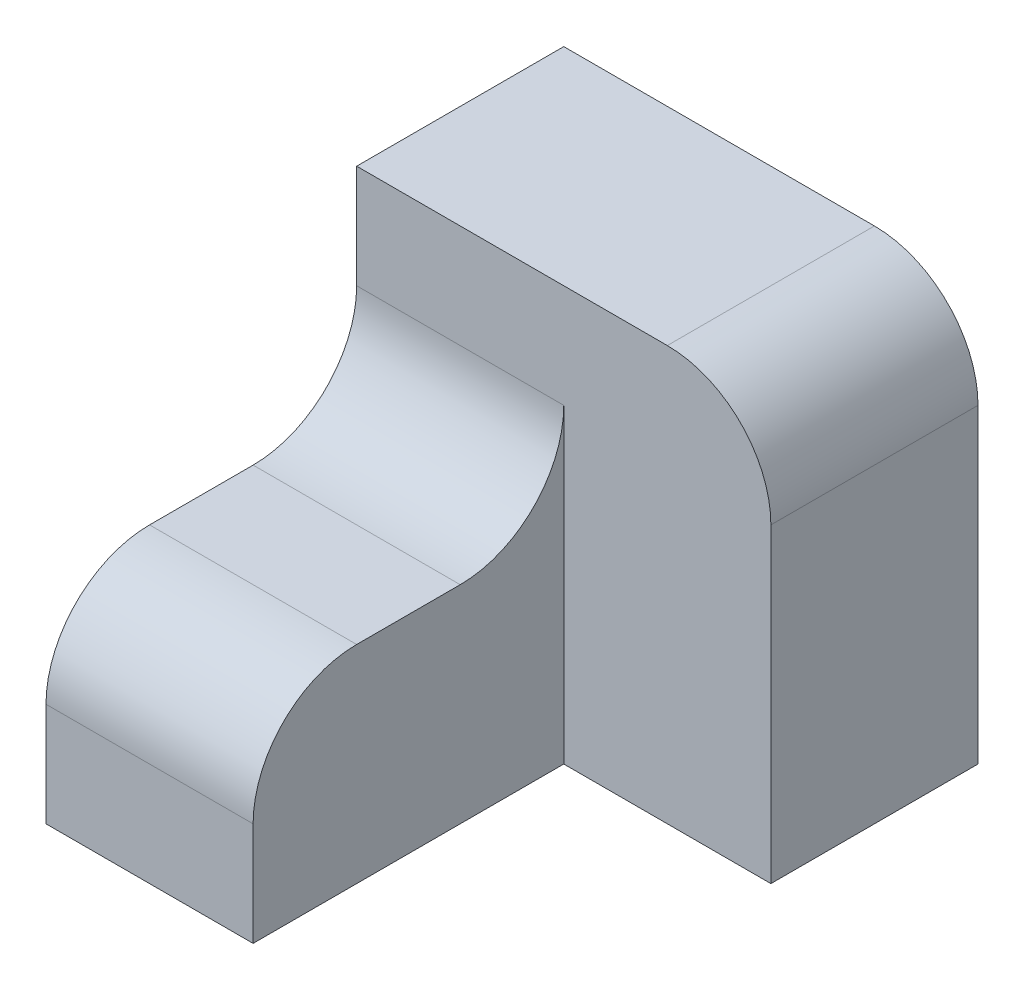
ISO-10303-21;
HEADER;
FILE_DESCRIPTION(('STEP AP214'),'2;1');
FILE_NAME('part.step','',(''),(''),'','','');
FILE_SCHEMA(('AUTOMOTIVE_DESIGN { 1 0 10303 214 1 1 1 1 }'));
ENDSEC;
DATA;
#1=APPLICATION_CONTEXT('core data for automotive mechanical design processes');
#2=APPLICATION_PROTOCOL_DEFINITION('international standard','automotive_design',2000,#1);
#3=PRODUCT_CONTEXT('',#1,'mechanical');
#4=PRODUCT('Part','Part','',(#3));
#5=PRODUCT_RELATED_PRODUCT_CATEGORY('part','',(#4));
#6=PRODUCT_DEFINITION_FORMATION('','',#4);
#7=PRODUCT_DEFINITION_CONTEXT('part definition',#1,'design');
#8=PRODUCT_DEFINITION('design','',#6,#7);
#9=PRODUCT_DEFINITION_SHAPE('','',#8);
#10=(LENGTH_UNIT() NAMED_UNIT(*) SI_UNIT(.MILLI.,.METRE.));
#11=(NAMED_UNIT(*) PLANE_ANGLE_UNIT() SI_UNIT($,.RADIAN.));
#12=(NAMED_UNIT(*) SI_UNIT($,.STERADIAN.) SOLID_ANGLE_UNIT());
#13=UNCERTAINTY_MEASURE_WITH_UNIT(LENGTH_MEASURE(1.E-05),#10,'distance_accuracy_value','');
#14=(GEOMETRIC_REPRESENTATION_CONTEXT(3) GLOBAL_UNCERTAINTY_ASSIGNED_CONTEXT((#13)) GLOBAL_UNIT_ASSIGNED_CONTEXT((#10,
#11,#12)) REPRESENTATION_CONTEXT('',''));
#15=CARTESIAN_POINT('',(0.,0.,0.));
#16=DIRECTION('',(0.,0.,1.));
#17=DIRECTION('',(1.,0.,0.));
#18=AXIS2_PLACEMENT_3D('',#15,#16,#17);
#19=CARTESIAN_POINT('',(-10.,0.,30.));
#20=DIRECTION('',(0.,-1.,0.));
#21=DIRECTION('',(1.,0.,0.));
#22=AXIS2_PLACEMENT_3D('',#19,#20,#21);
#23=PLANE('',#22);
#24=DIRECTION('',(0.,0.,-1.));
#25=VECTOR('',#24,1.);
#26=CARTESIAN_POINT('',(-10.,0.,30.));
#27=LINE('',#26,#25);
#28=CARTESIAN_POINT('',(-10.,0.,20.));
#29=VERTEX_POINT('',#28);
#30=CARTESIAN_POINT('',(-10.,0.,10.));
#31=VERTEX_POINT('',#30);
#32=EDGE_CURVE('E164',#29,#31,#27,.T.);
#33=ORIENTED_EDGE('',*,*,#32,.T.);
#34=DIRECTION('',(-1.,0.,0.));
#35=VECTOR('',#34,1.);
#36=CARTESIAN_POINT('',(-10.,0.,10.));
#37=LINE('',#36,#35);
#38=CARTESIAN_POINT('',(-30.,0.,10.));
#39=VERTEX_POINT('',#38);
#40=EDGE_CURVE('E178',#31,#39,#37,.T.);
#41=ORIENTED_EDGE('',*,*,#40,.T.);
#42=DIRECTION('',(0.,0.,-1.));
#43=VECTOR('',#42,1.);
#44=CARTESIAN_POINT('',(-30.,0.,30.));
#45=LINE('',#44,#43);
#46=CARTESIAN_POINT('',(-30.,0.,20.));
#47=VERTEX_POINT('',#46);
#48=EDGE_CURVE('E173',#47,#39,#45,.T.);
#49=ORIENTED_EDGE('',*,*,#48,.F.);
#50=DIRECTION('',(-1.,0.,0.));
#51=VECTOR('',#50,1.);
#52=CARTESIAN_POINT('',(-10.,0.,20.));
#53=LINE('',#52,#51);
#54=EDGE_CURVE('E176',#47,#29,#53,.F.);
#55=ORIENTED_EDGE('',*,*,#54,.T.);
#56=EDGE_LOOP('',(#33,#41,#49,#55));
#57=FACE_BOUND('',#56,.T.);
#58=ADVANCED_FACE('F35',(#57),#23,.F.);
#59=CARTESIAN_POINT('',(-30.,0.,30.));
#60=DIRECTION('',(1.,0.,0.));
#61=DIRECTION('',(0.,0.,-1.));
#62=AXIS2_PLACEMENT_3D('',#59,#60,#61);
#63=PLANE('',#62);
#64=DIRECTION('',(0.,-1.,0.));
#65=VECTOR('',#64,1.);
#66=CARTESIAN_POINT('',(-30.,0.,30.));
#67=LINE('',#66,#65);
#68=CARTESIAN_POINT('',(-30.,-10.,30.));
#69=VERTEX_POINT('',#68);
#70=CARTESIAN_POINT('',(-30.,-20.,30.));
#71=VERTEX_POINT('',#70);
#72=EDGE_CURVE('E158',#69,#71,#67,.T.);
#73=ORIENTED_EDGE('',*,*,#72,.F.);
#74=CARTESIAN_POINT('',(-30.,-10.,20.));
#75=DIRECTION('',(1.,0.,0.));
#76=DIRECTION('',(0.,0.,-1.));
#77=AXIS2_PLACEMENT_3D('',#74,#75,#76);
#78=CIRCLE('',#77,10.);
#79=EDGE_CURVE('E58',#69,#47,#78,.F.);
#80=ORIENTED_EDGE('',*,*,#79,.T.);
#81=ORIENTED_EDGE('',*,*,#48,.T.);
#82=CARTESIAN_POINT('',(-30.,10.,10.));
#83=DIRECTION('',(1.,0.,0.));
#84=DIRECTION('',(0.,0.,-1.));
#85=AXIS2_PLACEMENT_3D('',#82,#83,#84);
#86=CIRCLE('',#85,10.);
#87=CARTESIAN_POINT('',(-30.,10.,0.));
#88=VERTEX_POINT('',#87);
#89=EDGE_CURVE('E43',#39,#88,#86,.T.);
#90=ORIENTED_EDGE('',*,*,#89,.T.);
#91=DIRECTION('',(0.,-1.,0.));
#92=VECTOR('',#91,1.);
#93=CARTESIAN_POINT('',(-30.,20.,0.));
#94=LINE('',#93,#92);
#95=CARTESIAN_POINT('',(-30.,20.,0.));
#96=VERTEX_POINT('',#95);
#97=EDGE_CURVE('E134',#96,#88,#94,.T.);
#98=ORIENTED_EDGE('',*,*,#97,.F.);
#99=DIRECTION('',(0.,0.,1.));
#100=VECTOR('',#99,1.);
#101=CARTESIAN_POINT('',(-30.,20.,-20.));
#102=LINE('',#101,#100);
#103=CARTESIAN_POINT('',(-30.,20.,-20.));
#104=VERTEX_POINT('',#103);
#105=EDGE_CURVE('E118',#104,#96,#102,.T.);
#106=ORIENTED_EDGE('',*,*,#105,.F.);
#107=DIRECTION('',(0.,-1.,0.));
#108=VECTOR('',#107,1.);
#109=CARTESIAN_POINT('',(-30.,20.,-20.));
#110=LINE('',#109,#108);
#111=CARTESIAN_POINT('',(-30.,-20.,-20.));
#112=VERTEX_POINT('',#111);
#113=EDGE_CURVE('E125',#104,#112,#110,.T.);
#114=ORIENTED_EDGE('',*,*,#113,.T.);
#115=DIRECTION('',(0.,0.,-1.));
#116=VECTOR('',#115,1.);
#117=CARTESIAN_POINT('',(-30.,-20.,30.));
#118=LINE('',#117,#116);
#119=EDGE_CURVE('E171',#71,#112,#118,.T.);
#120=ORIENTED_EDGE('',*,*,#119,.F.);
#121=EDGE_LOOP('',(#73,#80,#81,#90,#98,#106,#114,#120));
#122=FACE_BOUND('',#121,.T.);
#123=ADVANCED_FACE('F131',(#122),#63,.F.);
#124=CARTESIAN_POINT('',(-30.,-20.,30.));
#125=DIRECTION('',(0.,1.,0.));
#126=DIRECTION('',(0.,0.,1.));
#127=AXIS2_PLACEMENT_3D('',#124,#125,#126);
#128=PLANE('',#127);
#129=ORIENTED_EDGE('',*,*,#119,.T.);
#130=DIRECTION('',(1.,0.,0.));
#131=VECTOR('',#130,1.);
#132=CARTESIAN_POINT('',(-30.,-20.,-20.));
#133=LINE('',#132,#131);
#134=CARTESIAN_POINT('',(10.,-20.,-20.));
#135=VERTEX_POINT('',#134);
#136=EDGE_CURVE('E142',#112,#135,#133,.T.);
#137=ORIENTED_EDGE('',*,*,#136,.T.);
#138=DIRECTION('',(0.,0.,1.));
#139=VECTOR('',#138,1.);
#140=CARTESIAN_POINT('',(10.,-20.,-20.));
#141=LINE('',#140,#139);
#142=CARTESIAN_POINT('',(10.,-20.,0.));
#143=VERTEX_POINT('',#142);
#144=EDGE_CURVE('E135',#135,#143,#141,.T.);
#145=ORIENTED_EDGE('',*,*,#144,.T.);
#146=DIRECTION('',(1.,0.,0.));
#147=VECTOR('',#146,1.);
#148=CARTESIAN_POINT('',(-30.,-20.,0.));
#149=LINE('',#148,#147);
#150=CARTESIAN_POINT('',(-10.,-20.,0.));
#151=VERTEX_POINT('',#150);
#152=EDGE_CURVE('E151',#151,#143,#149,.T.);
#153=ORIENTED_EDGE('',*,*,#152,.F.);
#154=DIRECTION('',(0.,0.,-1.));
#155=VECTOR('',#154,1.);
#156=CARTESIAN_POINT('',(-10.,-20.,30.));
#157=LINE('',#156,#155);
#158=CARTESIAN_POINT('',(-10.,-20.,30.));
#159=VERTEX_POINT('',#158);
#160=EDGE_CURVE('E168',#159,#151,#157,.T.);
#161=ORIENTED_EDGE('',*,*,#160,.F.);
#162=DIRECTION('',(1.,0.,0.));
#163=VECTOR('',#162,1.);
#164=CARTESIAN_POINT('',(-30.,-20.,30.));
#165=LINE('',#164,#163);
#166=EDGE_CURVE('E160',#71,#159,#165,.T.);
#167=ORIENTED_EDGE('',*,*,#166,.F.);
#168=EDGE_LOOP('',(#129,#137,#145,#153,#161,#167));
#169=FACE_BOUND('',#168,.T.);
#170=ADVANCED_FACE('F210',(#169),#128,.F.);
#171=CARTESIAN_POINT('',(-10.,-20.,30.));
#172=DIRECTION('',(-1.,0.,0.));
#173=DIRECTION('',(0.,0.,1.));
#174=AXIS2_PLACEMENT_3D('',#171,#172,#173);
#175=PLANE('',#174);
#176=ORIENTED_EDGE('',*,*,#32,.F.);
#177=CARTESIAN_POINT('',(-10.,-10.,20.));
#178=DIRECTION('',(-1.,0.,0.));
#179=DIRECTION('',(0.,0.,1.));
#180=AXIS2_PLACEMENT_3D('',#177,#178,#179);
#181=CIRCLE('',#180,10.);
#182=CARTESIAN_POINT('',(-10.,-10.,30.));
#183=VERTEX_POINT('',#182);
#184=EDGE_CURVE('E50',#29,#183,#181,.F.);
#185=ORIENTED_EDGE('',*,*,#184,.T.);
#186=DIRECTION('',(0.,1.,0.));
#187=VECTOR('',#186,1.);
#188=CARTESIAN_POINT('',(-10.,-20.,30.));
#189=LINE('',#188,#187);
#190=EDGE_CURVE('E162',#159,#183,#189,.T.);
#191=ORIENTED_EDGE('',*,*,#190,.F.);
#192=ORIENTED_EDGE('',*,*,#160,.T.);
#193=DIRECTION('',(0.,1.,0.));
#194=VECTOR('',#193,1.);
#195=CARTESIAN_POINT('',(-10.,-20.,0.));
#196=LINE('',#195,#194);
#197=CARTESIAN_POINT('',(-10.,9.99999999999999,0.));
#198=VERTEX_POINT('',#197);
#199=EDGE_CURVE('E156',#151,#198,#196,.T.);
#200=ORIENTED_EDGE('',*,*,#199,.T.);
#201=CARTESIAN_POINT('',(-10.,10.,10.));
#202=DIRECTION('',(-1.,0.,0.));
#203=DIRECTION('',(0.,0.,1.));
#204=AXIS2_PLACEMENT_3D('',#201,#202,#203);
#205=CIRCLE('',#204,10.);
#206=EDGE_CURVE('E11',#198,#31,#205,.T.);
#207=ORIENTED_EDGE('',*,*,#206,.T.);
#208=EDGE_LOOP('',(#176,#185,#191,#192,#200,#207));
#209=FACE_BOUND('',#208,.T.);
#210=ADVANCED_FACE('F203',(#209),#175,.F.);
#211=CARTESIAN_POINT('',(0.,0.,30.));
#212=DIRECTION('',(0.,0.,1.));
#213=DIRECTION('',(1.,0.,0.));
#214=AXIS2_PLACEMENT_3D('',#211,#212,#213);
#215=PLANE('',#214);
#216=ORIENTED_EDGE('',*,*,#190,.T.);
#217=DIRECTION('',(-1.,0.,0.));
#218=VECTOR('',#217,1.);
#219=CARTESIAN_POINT('',(-30.,-10.,30.));
#220=LINE('',#219,#218);
#221=EDGE_CURVE('E192',#183,#69,#220,.T.);
#222=ORIENTED_EDGE('',*,*,#221,.T.);
#223=ORIENTED_EDGE('',*,*,#72,.T.);
#224=ORIENTED_EDGE('',*,*,#166,.T.);
#225=EDGE_LOOP('',(#216,#222,#223,#224));
#226=FACE_BOUND('',#225,.T.);
#227=ADVANCED_FACE('F206',(#226),#215,.T.);
#228=CARTESIAN_POINT('',(0.,0.,0.));
#229=DIRECTION('',(0.,0.,1.));
#230=DIRECTION('',(1.,0.,0.));
#231=AXIS2_PLACEMENT_3D('',#228,#229,#230);
#232=PLANE('',#231);
#233=ORIENTED_EDGE('',*,*,#97,.T.);
#234=DIRECTION('',(-1.,0.,0.));
#235=VECTOR('',#234,1.);
#236=CARTESIAN_POINT('',(0.,10.,0.));
#237=LINE('',#236,#235);
#238=EDGE_CURVE('E183',#88,#198,#237,.F.);
#239=ORIENTED_EDGE('',*,*,#238,.T.);
#240=ORIENTED_EDGE('',*,*,#199,.F.);
#241=ORIENTED_EDGE('',*,*,#152,.T.);
#242=DIRECTION('',(0.,1.,0.));
#243=VECTOR('',#242,1.);
#244=CARTESIAN_POINT('',(10.,-20.,0.));
#245=LINE('',#244,#243);
#246=CARTESIAN_POINT('',(10.,9.99999999999999,0.));
#247=VERTEX_POINT('',#246);
#248=EDGE_CURVE('E126',#143,#247,#245,.T.);
#249=ORIENTED_EDGE('',*,*,#248,.T.);
#250=CARTESIAN_POINT('',(0.,9.99999999999999,0.));
#251=DIRECTION('',(0.,0.,1.));
#252=DIRECTION('',(1.,0.,0.));
#253=AXIS2_PLACEMENT_3D('',#250,#251,#252);
#254=CIRCLE('',#253,10.);
#255=CARTESIAN_POINT('',(0.,20.,0.));
#256=VERTEX_POINT('',#255);
#257=EDGE_CURVE('E181',#247,#256,#254,.T.);
#258=ORIENTED_EDGE('',*,*,#257,.T.);
#259=DIRECTION('',(-1.,0.,0.));
#260=VECTOR('',#259,1.);
#261=CARTESIAN_POINT('',(10.,20.,0.));
#262=LINE('',#261,#260);
#263=EDGE_CURVE('E148',#256,#96,#262,.T.);
#264=ORIENTED_EDGE('',*,*,#263,.T.);
#265=EDGE_LOOP('',(#233,#239,#240,#241,#249,#258,#264));
#266=FACE_BOUND('',#265,.T.);
#267=ADVANCED_FACE('F200',(#266),#232,.T.);
#268=CARTESIAN_POINT('',(10.,20.,-20.));
#269=DIRECTION('',(0.,1.,0.));
#270=DIRECTION('',(-1.,0.,0.));
#271=AXIS2_PLACEMENT_3D('',#268,#269,#270);
#272=PLANE('',#271);
#273=ORIENTED_EDGE('',*,*,#263,.F.);
#274=DIRECTION('',(0.,0.,1.));
#275=VECTOR('',#274,1.);
#276=CARTESIAN_POINT('',(0.,20.,-20.));
#277=LINE('',#276,#275);
#278=CARTESIAN_POINT('',(0.,20.,-20.));
#279=VERTEX_POINT('',#278);
#280=EDGE_CURVE('E121',#256,#279,#277,.F.);
#281=ORIENTED_EDGE('',*,*,#280,.T.);
#282=DIRECTION('',(-1.,0.,0.));
#283=VECTOR('',#282,1.);
#284=CARTESIAN_POINT('',(10.,20.,-20.));
#285=LINE('',#284,#283);
#286=EDGE_CURVE('E114',#279,#104,#285,.T.);
#287=ORIENTED_EDGE('',*,*,#286,.T.);
#288=ORIENTED_EDGE('',*,*,#105,.T.);
#289=EDGE_LOOP('',(#273,#281,#287,#288));
#290=FACE_BOUND('',#289,.T.);
#291=ADVANCED_FACE('F117',(#290),#272,.T.);
#292=CARTESIAN_POINT('',(10.,-20.,-20.));
#293=DIRECTION('',(1.,0.,0.));
#294=DIRECTION('',(0.,0.,-1.));
#295=AXIS2_PLACEMENT_3D('',#292,#293,#294);
#296=PLANE('',#295);
#297=DIRECTION('',(0.,1.,0.));
#298=VECTOR('',#297,1.);
#299=CARTESIAN_POINT('',(10.,-20.,-20.));
#300=LINE('',#299,#298);
#301=CARTESIAN_POINT('',(10.,9.99999999999999,-20.));
#302=VERTEX_POINT('',#301);
#303=EDGE_CURVE('E136',#135,#302,#300,.T.);
#304=ORIENTED_EDGE('',*,*,#303,.T.);
#305=DIRECTION('',(0.,0.,1.));
#306=VECTOR('',#305,1.);
#307=CARTESIAN_POINT('',(10.,9.99999999999999,-20.));
#308=LINE('',#307,#306);
#309=EDGE_CURVE('E186',#302,#247,#308,.T.);
#310=ORIENTED_EDGE('',*,*,#309,.T.);
#311=ORIENTED_EDGE('',*,*,#248,.F.);
#312=ORIENTED_EDGE('',*,*,#144,.F.);
#313=EDGE_LOOP('',(#304,#310,#311,#312));
#314=FACE_BOUND('',#313,.T.);
#315=ADVANCED_FACE('F214',(#314),#296,.T.);
#316=CARTESIAN_POINT('',(0.,0.,-20.));
#317=DIRECTION('',(0.,0.,1.));
#318=DIRECTION('',(1.,0.,0.));
#319=AXIS2_PLACEMENT_3D('',#316,#317,#318);
#320=PLANE('',#319);
#321=ORIENTED_EDGE('',*,*,#286,.F.);
#322=CARTESIAN_POINT('',(0.,9.99999999999999,-20.));
#323=DIRECTION('',(0.,0.,1.));
#324=DIRECTION('',(1.,0.,0.));
#325=AXIS2_PLACEMENT_3D('',#322,#323,#324);
#326=CIRCLE('',#325,10.);
#327=EDGE_CURVE('E190',#279,#302,#326,.F.);
#328=ORIENTED_EDGE('',*,*,#327,.T.);
#329=ORIENTED_EDGE('',*,*,#303,.F.);
#330=ORIENTED_EDGE('',*,*,#136,.F.);
#331=ORIENTED_EDGE('',*,*,#113,.F.);
#332=EDGE_LOOP('',(#321,#328,#329,#330,#331));
#333=FACE_BOUND('',#332,.T.);
#334=ADVANCED_FACE('F139',(#333),#320,.F.);
#335=CARTESIAN_POINT('',(-10.,10.,10.));
#336=DIRECTION('',(-1.,0.,0.));
#337=DIRECTION('',(0.,-1.,0.));
#338=AXIS2_PLACEMENT_3D('',#335,#336,#337);
#339=CYLINDRICAL_SURFACE('',#338,10.);
#340=ORIENTED_EDGE('',*,*,#206,.F.);
#341=ORIENTED_EDGE('',*,*,#238,.F.);
#342=ORIENTED_EDGE('',*,*,#89,.F.);
#343=ORIENTED_EDGE('',*,*,#40,.F.);
#344=EDGE_LOOP('',(#340,#341,#342,#343));
#345=FACE_BOUND('',#344,.T.);
#346=ADVANCED_FACE('F202',(#345),#339,.F.);
#347=CARTESIAN_POINT('',(0.,9.99999999999999,-20.));
#348=DIRECTION('',(0.,0.,1.));
#349=DIRECTION('',(1.,0.,0.));
#350=AXIS2_PLACEMENT_3D('',#347,#348,#349);
#351=CYLINDRICAL_SURFACE('',#350,10.);
#352=ORIENTED_EDGE('',*,*,#327,.F.);
#353=ORIENTED_EDGE('',*,*,#280,.F.);
#354=ORIENTED_EDGE('',*,*,#257,.F.);
#355=ORIENTED_EDGE('',*,*,#309,.F.);
#356=EDGE_LOOP('',(#352,#353,#354,#355));
#357=FACE_BOUND('',#356,.T.);
#358=ADVANCED_FACE('F217',(#357),#351,.T.);
#359=CARTESIAN_POINT('',(0.,-10.,20.));
#360=DIRECTION('',(1.,0.,0.));
#361=DIRECTION('',(0.,1.,0.));
#362=AXIS2_PLACEMENT_3D('',#359,#360,#361);
#363=CYLINDRICAL_SURFACE('',#362,10.);
#364=ORIENTED_EDGE('',*,*,#184,.F.);
#365=ORIENTED_EDGE('',*,*,#54,.F.);
#366=ORIENTED_EDGE('',*,*,#79,.F.);
#367=ORIENTED_EDGE('',*,*,#221,.F.);
#368=EDGE_LOOP('',(#364,#365,#366,#367));
#369=FACE_BOUND('',#368,.T.);
#370=ADVANCED_FACE('F37',(#369),#363,.T.);
#371=CLOSED_SHELL('',(#58,#123,#170,#210,#227,#267,#291,#315,#334,#346,#358,#370));
#372=MANIFOLD_SOLID_BREP('B2',#371);
#373=ADVANCED_BREP_SHAPE_REPRESENTATION('',(#18,#372),#14);
#374=SHAPE_DEFINITION_REPRESENTATION(#9,#373);
ENDSEC;
END-ISO-10303-21;
